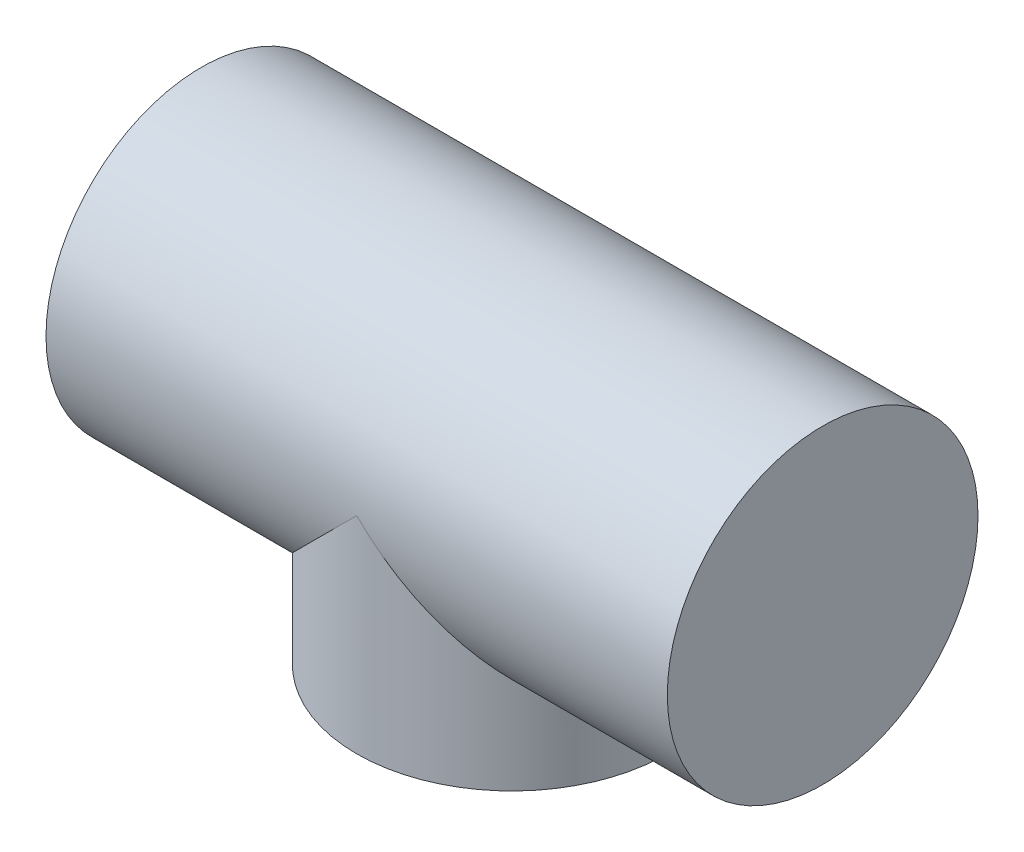
ISO-10303-21;
HEADER;
FILE_DESCRIPTION(('STEP AP214'),'2;1');
FILE_NAME('part.step','',(''),(''),'','','');
FILE_SCHEMA(('AUTOMOTIVE_DESIGN { 1 0 10303 214 1 1 1 1 }'));
ENDSEC;
DATA;
#1=APPLICATION_CONTEXT('core data for automotive mechanical design processes');
#2=APPLICATION_PROTOCOL_DEFINITION('international standard','automotive_design',2000,#1);
#3=PRODUCT_CONTEXT('',#1,'mechanical');
#4=PRODUCT('Part','Part','',(#3));
#5=PRODUCT_RELATED_PRODUCT_CATEGORY('part','',(#4));
#6=PRODUCT_DEFINITION_FORMATION('','',#4);
#7=PRODUCT_DEFINITION_CONTEXT('part definition',#1,'design');
#8=PRODUCT_DEFINITION('design','',#6,#7);
#9=PRODUCT_DEFINITION_SHAPE('','',#8);
#10=(LENGTH_UNIT() NAMED_UNIT(*) SI_UNIT(.MILLI.,.METRE.));
#11=(NAMED_UNIT(*) PLANE_ANGLE_UNIT() SI_UNIT($,.RADIAN.));
#12=(NAMED_UNIT(*) SI_UNIT($,.STERADIAN.) SOLID_ANGLE_UNIT());
#13=UNCERTAINTY_MEASURE_WITH_UNIT(LENGTH_MEASURE(1.E-05),#10,'distance_accuracy_value','');
#14=(GEOMETRIC_REPRESENTATION_CONTEXT(3) GLOBAL_UNCERTAINTY_ASSIGNED_CONTEXT((#13)) GLOBAL_UNIT_ASSIGNED_CONTEXT((#10,
#11,#12)) REPRESENTATION_CONTEXT('',''));
#15=CARTESIAN_POINT('',(0.,0.,0.));
#16=DIRECTION('',(0.,0.,1.));
#17=DIRECTION('',(1.,0.,0.));
#18=AXIS2_PLACEMENT_3D('',#15,#16,#17);
#19=CARTESIAN_POINT('',(0.,0.,0.));
#20=DIRECTION('',(1.,0.,0.));
#21=DIRECTION('',(0.,0.,-1.));
#22=AXIS2_PLACEMENT_3D('',#19,#20,#21);
#23=PLANE('',#22);
#24=CARTESIAN_POINT('',(0.,0.,0.));
#25=DIRECTION('',(1.,0.,0.));
#26=DIRECTION('',(0.,0.,-1.));
#27=AXIS2_PLACEMENT_3D('',#24,#25,#26);
#28=CIRCLE('',#27,25.);
#29=CARTESIAN_POINT('',(0.,0.,-25.));
#30=VERTEX_POINT('',#29);
#31=EDGE_CURVE('E69',#30,#30,#28,.T.);
#32=ORIENTED_EDGE('',*,*,#31,.F.);
#33=EDGE_LOOP('',(#32));
#34=FACE_BOUND('',#33,.T.);
#35=ADVANCED_FACE('F46',(#34),#23,.F.);
#36=CARTESIAN_POINT('',(100.,0.,0.));
#37=DIRECTION('',(1.,0.,0.));
#38=DIRECTION('',(0.,0.,-1.));
#39=AXIS2_PLACEMENT_3D('',#36,#37,#38);
#40=PLANE('',#39);
#41=CARTESIAN_POINT('',(100.,0.,0.));
#42=DIRECTION('',(1.,0.,0.));
#43=DIRECTION('',(0.,0.,-1.));
#44=AXIS2_PLACEMENT_3D('',#41,#42,#43);
#45=CIRCLE('',#44,25.);
#46=CARTESIAN_POINT('',(100.,0.,-25.));
#47=VERTEX_POINT('',#46);
#48=EDGE_CURVE('E65',#47,#47,#45,.T.);
#49=ORIENTED_EDGE('',*,*,#48,.T.);
#50=EDGE_LOOP('',(#49));
#51=FACE_BOUND('',#50,.T.);
#52=ADVANCED_FACE('F90',(#51),#40,.T.);
#53=CARTESIAN_POINT('',(0.,0.,0.));
#54=DIRECTION('',(1.,0.,0.));
#55=DIRECTION('',(0.,0.,-1.));
#56=AXIS2_PLACEMENT_3D('',#53,#54,#55);
#57=CYLINDRICAL_SURFACE('',#56,25.);
#58=CARTESIAN_POINT('',(50.,0.,0.));
#59=DIRECTION('',(0.707106781186548,0.707106781186547,0.));
#60=DIRECTION('',(0.707106781186548,-0.707106781186547,0.));
#61=AXIS2_PLACEMENT_3D('',#58,#59,#60);
#62=ELLIPSE('',#61,35.3553390593274,25.);
#63=CARTESIAN_POINT('',(50.,0.,-25.));
#64=VERTEX_POINT('',#63);
#65=CARTESIAN_POINT('',(50.,0.,25.));
#66=VERTEX_POINT('',#65);
#67=EDGE_CURVE('E11',#64,#66,#62,.F.);
#68=ORIENTED_EDGE('',*,*,#67,.F.);
#69=CARTESIAN_POINT('',(50.,0.,0.));
#70=DIRECTION('',(0.707106781186548,-0.707106781186547,0.));
#71=DIRECTION('',(0.707106781186548,0.707106781186547,0.));
#72=AXIS2_PLACEMENT_3D('',#69,#70,#71);
#73=ELLIPSE('',#72,35.3553390593274,25.);
#74=EDGE_CURVE('E54',#66,#64,#73,.T.);
#75=ORIENTED_EDGE('',*,*,#74,.F.);
#76=EDGE_LOOP('',(#68,#75));
#77=FACE_BOUND('',#76,.T.);
#78=ORIENTED_EDGE('',*,*,#48,.F.);
#79=EDGE_LOOP('',(#78));
#80=FACE_BOUND('',#79,.T.);
#81=ORIENTED_EDGE('',*,*,#31,.T.);
#82=EDGE_LOOP('',(#81));
#83=FACE_BOUND('',#82,.T.);
#84=ADVANCED_FACE('F60',(#77,#80,#83),#57,.T.);
#85=CARTESIAN_POINT('',(50.,-33.2,0.));
#86=DIRECTION('',(0.,1.,0.));
#87=DIRECTION('',(0.,0.,1.));
#88=AXIS2_PLACEMENT_3D('',#85,#86,#87);
#89=CYLINDRICAL_SURFACE('',#88,25.);
#90=CARTESIAN_POINT('',(50.,-33.2,0.));
#91=DIRECTION('',(0.,1.,0.));
#92=DIRECTION('',(0.,0.,1.));
#93=AXIS2_PLACEMENT_3D('',#90,#91,#92);
#94=CIRCLE('',#93,25.);
#95=CARTESIAN_POINT('',(50.,-33.2,25.));
#96=VERTEX_POINT('',#95);
#97=EDGE_CURVE('E75',#96,#96,#94,.T.);
#98=ORIENTED_EDGE('',*,*,#97,.T.);
#99=EDGE_LOOP('',(#98));
#100=FACE_BOUND('',#99,.T.);
#101=ORIENTED_EDGE('',*,*,#74,.T.);
#102=ORIENTED_EDGE('',*,*,#67,.T.);
#103=EDGE_LOOP('',(#101,#102));
#104=FACE_BOUND('',#103,.T.);
#105=ADVANCED_FACE('F63',(#100,#104),#89,.T.);
#106=CARTESIAN_POINT('',(50.,-33.2,0.));
#107=DIRECTION('',(0.,1.,0.));
#108=DIRECTION('',(0.,0.,1.));
#109=AXIS2_PLACEMENT_3D('',#106,#107,#108);
#110=PLANE('',#109);
#111=ORIENTED_EDGE('',*,*,#97,.F.);
#112=EDGE_LOOP('',(#111));
#113=FACE_BOUND('',#112,.T.);
#114=ADVANCED_FACE('F82',(#113),#110,.F.);
#115=CLOSED_SHELL('',(#35,#52,#84,#105,#114));
#116=MANIFOLD_SOLID_BREP('B2',#115);
#117=ADVANCED_BREP_SHAPE_REPRESENTATION('',(#18,#116),#14);
#118=SHAPE_DEFINITION_REPRESENTATION(#9,#117);
ENDSEC;
END-ISO-10303-21;
